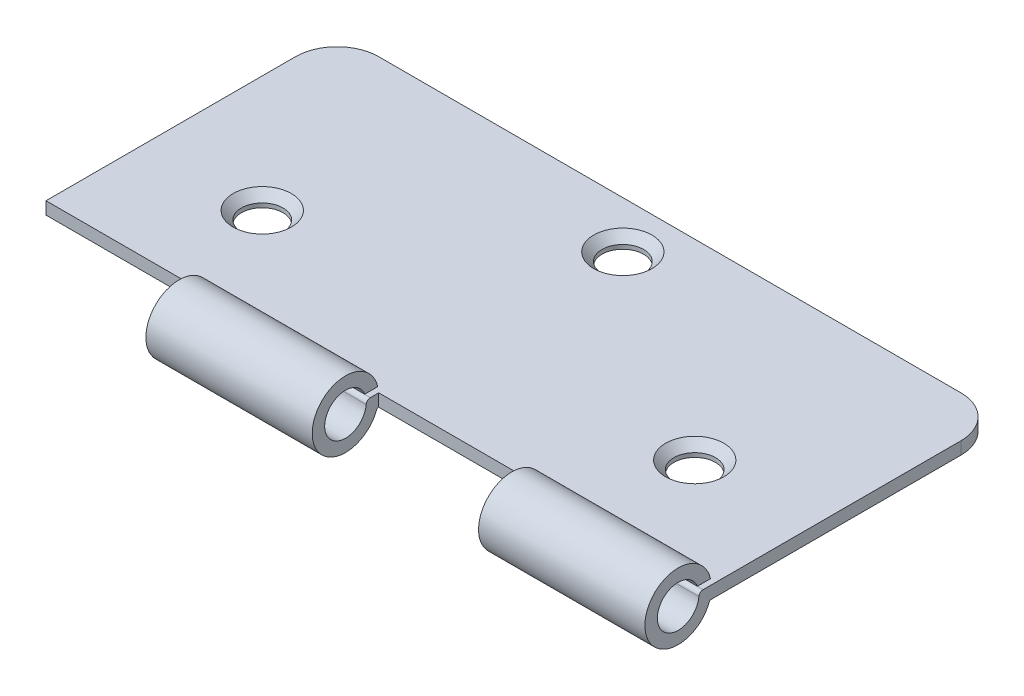
ISO-10303-21;
HEADER;
FILE_DESCRIPTION(('STEP AP214'),'2;1');
FILE_NAME('part.step','',(''),(''),'','','');
FILE_SCHEMA(('AUTOMOTIVE_DESIGN { 1 0 10303 214 1 1 1 1 }'));
ENDSEC;
DATA;
#1=APPLICATION_CONTEXT('core data for automotive mechanical design processes');
#2=APPLICATION_PROTOCOL_DEFINITION('international standard','automotive_design',2000,#1);
#3=PRODUCT_CONTEXT('',#1,'mechanical');
#4=PRODUCT('Part','Part','',(#3));
#5=PRODUCT_RELATED_PRODUCT_CATEGORY('part','',(#4));
#6=PRODUCT_DEFINITION_FORMATION('','',#4);
#7=PRODUCT_DEFINITION_CONTEXT('part definition',#1,'design');
#8=PRODUCT_DEFINITION('design','',#6,#7);
#9=PRODUCT_DEFINITION_SHAPE('','',#8);
#10=(LENGTH_UNIT() NAMED_UNIT(*) SI_UNIT(.MILLI.,.METRE.));
#11=(NAMED_UNIT(*) PLANE_ANGLE_UNIT() SI_UNIT($,.RADIAN.));
#12=(NAMED_UNIT(*) SI_UNIT($,.STERADIAN.) SOLID_ANGLE_UNIT());
#13=UNCERTAINTY_MEASURE_WITH_UNIT(LENGTH_MEASURE(1.E-05),#10,'distance_accuracy_value','');
#14=(GEOMETRIC_REPRESENTATION_CONTEXT(3) GLOBAL_UNCERTAINTY_ASSIGNED_CONTEXT((#13)) GLOBAL_UNIT_ASSIGNED_CONTEXT((#10,
#11,#12)) REPRESENTATION_CONTEXT('',''));
#15=CARTESIAN_POINT('',(0.,0.,0.));
#16=DIRECTION('',(0.,0.,1.));
#17=DIRECTION('',(1.,0.,0.));
#18=AXIS2_PLACEMENT_3D('',#15,#16,#17);
#19=CARTESIAN_POINT('',(-40.,1.5,17.5));
#20=DIRECTION('',(0.,0.,-1.));
#21=DIRECTION('',(-1.,0.,0.));
#22=AXIS2_PLACEMENT_3D('',#19,#20,#21);
#23=PLANE('',#22);
#24=DIRECTION('',(0.,1.,0.));
#25=VECTOR('',#24,1.);
#26=CARTESIAN_POINT('',(0.,1.5,17.5));
#27=LINE('',#26,#25);
#28=CARTESIAN_POINT('',(0.,0.,17.5));
#29=VERTEX_POINT('',#28);
#30=CARTESIAN_POINT('',(0.,1.5,17.5));
#31=VERTEX_POINT('',#30);
#32=EDGE_CURVE('E240',#29,#31,#27,.T.);
#33=ORIENTED_EDGE('',*,*,#32,.F.);
#34=DIRECTION('',(1.,0.,0.));
#35=VECTOR('',#34,1.);
#36=CARTESIAN_POINT('',(-40.,0.,17.5));
#37=LINE('',#36,#35);
#38=CARTESIAN_POINT('',(20.,0.,17.5));
#39=VERTEX_POINT('',#38);
#40=EDGE_CURVE('E368',#29,#39,#37,.T.);
#41=ORIENTED_EDGE('',*,*,#40,.T.);
#42=DIRECTION('',(0.,1.,0.));
#43=VECTOR('',#42,1.);
#44=CARTESIAN_POINT('',(20.,1.5,17.5));
#45=LINE('',#44,#43);
#46=CARTESIAN_POINT('',(20.,1.5,17.5));
#47=VERTEX_POINT('',#46);
#48=EDGE_CURVE('E282',#39,#47,#45,.T.);
#49=ORIENTED_EDGE('',*,*,#48,.T.);
#50=DIRECTION('',(1.,0.,0.));
#51=VECTOR('',#50,1.);
#52=CARTESIAN_POINT('',(-40.,1.5,17.5));
#53=LINE('',#52,#51);
#54=EDGE_CURVE('E57',#31,#47,#53,.T.);
#55=ORIENTED_EDGE('',*,*,#54,.F.);
#56=EDGE_LOOP('',(#33,#41,#49,#55));
#57=FACE_BOUND('',#56,.T.);
#58=ADVANCED_FACE('F41',(#57),#23,.F.);
#59=CARTESIAN_POINT('',(-40.,1.5,17.5));
#60=DIRECTION('',(1.,0.,0.));
#61=DIRECTION('',(0.,0.,-1.));
#62=AXIS2_PLACEMENT_3D('',#59,#60,#61);
#63=PLANE('',#62);
#64=DIRECTION('',(0.,0.,1.));
#65=VECTOR('',#64,1.);
#66=CARTESIAN_POINT('',(-40.,0.,17.5));
#67=LINE('',#66,#65);
#68=CARTESIAN_POINT('',(-40.,0.,-12.5));
#69=VERTEX_POINT('',#68);
#70=CARTESIAN_POINT('',(-40.,0.,17.5));
#71=VERTEX_POINT('',#70);
#72=EDGE_CURVE('E327',#69,#71,#67,.T.);
#73=ORIENTED_EDGE('',*,*,#72,.T.);
#74=DIRECTION('',(0.,-1.,0.));
#75=VECTOR('',#74,1.);
#76=CARTESIAN_POINT('',(-40.,1.5,17.5));
#77=LINE('',#76,#75);
#78=CARTESIAN_POINT('',(-40.,1.5,17.5));
#79=VERTEX_POINT('',#78);
#80=EDGE_CURVE('E398',#79,#71,#77,.T.);
#81=ORIENTED_EDGE('',*,*,#80,.F.);
#82=DIRECTION('',(0.,0.,1.));
#83=VECTOR('',#82,1.);
#84=CARTESIAN_POINT('',(-40.,1.5,17.5));
#85=LINE('',#84,#83);
#86=CARTESIAN_POINT('',(-40.,1.5,-12.5));
#87=VERTEX_POINT('',#86);
#88=EDGE_CURVE('E344',#87,#79,#85,.T.);
#89=ORIENTED_EDGE('',*,*,#88,.F.);
#90=DIRECTION('',(0.,-1.,0.));
#91=VECTOR('',#90,1.);
#92=CARTESIAN_POINT('',(-40.,1.5,-12.5));
#93=LINE('',#92,#91);
#94=EDGE_CURVE('E364',#87,#69,#93,.T.);
#95=ORIENTED_EDGE('',*,*,#94,.T.);
#96=EDGE_LOOP('',(#73,#81,#89,#95));
#97=FACE_BOUND('',#96,.T.);
#98=ADVANCED_FACE('F449',(#97),#63,.F.);
#99=CARTESIAN_POINT('',(-20.,0.,17.5));
#100=VERTEX_POINT('',#99);
#101=EDGE_CURVE('E369',#71,#100,#37,.T.);
#102=ORIENTED_EDGE('',*,*,#101,.T.);
#103=DIRECTION('',(0.,1.,0.));
#104=VECTOR('',#103,1.);
#105=CARTESIAN_POINT('',(-20.,1.5,17.5));
#106=LINE('',#105,#104);
#107=CARTESIAN_POINT('',(-20.,1.5,17.5));
#108=VERTEX_POINT('',#107);
#109=EDGE_CURVE('E65',#100,#108,#106,.T.);
#110=ORIENTED_EDGE('',*,*,#109,.T.);
#111=EDGE_CURVE('E349',#79,#108,#53,.T.);
#112=ORIENTED_EDGE('',*,*,#111,.F.);
#113=ORIENTED_EDGE('',*,*,#80,.T.);
#114=EDGE_LOOP('',(#102,#110,#112,#113));
#115=FACE_BOUND('',#114,.T.);
#116=ADVANCED_FACE('F451',(#115),#23,.F.);
#117=CARTESIAN_POINT('',(40.,1.5,17.5));
#118=DIRECTION('',(-1.,0.,0.));
#119=DIRECTION('',(0.,0.,1.));
#120=AXIS2_PLACEMENT_3D('',#117,#118,#119);
#121=PLANE('',#120);
#122=DIRECTION('',(0.,0.,-1.));
#123=VECTOR('',#122,1.);
#124=CARTESIAN_POINT('',(40.,0.,17.5));
#125=LINE('',#124,#123);
#126=CARTESIAN_POINT('',(40.,0.,17.5553280723627));
#127=VERTEX_POINT('',#126);
#128=CARTESIAN_POINT('',(40.,0.,-12.5));
#129=VERTEX_POINT('',#128);
#130=EDGE_CURVE('E372',#127,#129,#125,.T.);
#131=ORIENTED_EDGE('',*,*,#130,.T.);
#132=DIRECTION('',(0.,-1.,0.));
#133=VECTOR('',#132,1.);
#134=CARTESIAN_POINT('',(40.,1.5,-12.5));
#135=LINE('',#134,#133);
#136=CARTESIAN_POINT('',(40.,1.5,-12.5));
#137=VERTEX_POINT('',#136);
#138=EDGE_CURVE('E394',#137,#129,#135,.T.);
#139=ORIENTED_EDGE('',*,*,#138,.F.);
#140=DIRECTION('',(0.,0.,-1.));
#141=VECTOR('',#140,1.);
#142=CARTESIAN_POINT('',(40.,1.5,17.5));
#143=LINE('',#142,#141);
#144=CARTESIAN_POINT('',(40.,1.5,18.5042880989272));
#145=VERTEX_POINT('',#144);
#146=EDGE_CURVE('E352',#145,#137,#143,.T.);
#147=ORIENTED_EDGE('',*,*,#146,.F.);
#148=CARTESIAN_POINT('',(40.,1.,18.5042880989272));
#149=DIRECTION('',(1.,0.,0.));
#150=DIRECTION('',(0.,0.,-1.));
#151=AXIS2_PLACEMENT_3D('',#148,#149,#150);
#152=CIRCLE('',#151,0.500000000000001);
#153=CARTESIAN_POINT('',(40.,1.04356741446207,19.0023863627237));
#154=VERTEX_POINT('',#153);
#155=EDGE_CURVE('E309',#145,#154,#152,.T.);
#156=ORIENTED_EDGE('',*,*,#155,.T.);
#157=CARTESIAN_POINT('',(40.,1.2614044867724,21.4928776817062));
#158=DIRECTION('',(-1.,0.,0.));
#159=DIRECTION('',(0.,0.,-1.));
#160=AXIS2_PLACEMENT_3D('',#157,#158,#159);
#161=CIRCLE('',#160,2.5);
#162=CARTESIAN_POINT('',(40.,2.19386766545914,19.1732845233284));
#163=VERTEX_POINT('',#162);
#164=EDGE_CURVE('E313',#154,#163,#161,.T.);
#165=ORIENTED_EDGE('',*,*,#164,.T.);
#166=DIRECTION('',(0.,0.,-1.));
#167=VECTOR('',#166,1.);
#168=CARTESIAN_POINT('',(40.,2.19386766545914,19.1732845233284));
#169=LINE('',#168,#167);
#170=CARTESIAN_POINT('',(40.,2.19386766545914,17.6030817461341));
#171=VERTEX_POINT('',#170);
#172=EDGE_CURVE('E317',#163,#171,#169,.T.);
#173=ORIENTED_EDGE('',*,*,#172,.T.);
#174=CARTESIAN_POINT('',(40.,1.2614044867724,21.4928776817062));
#175=DIRECTION('',(1.,0.,0.));
#176=DIRECTION('',(0.,0.,-1.));
#177=AXIS2_PLACEMENT_3D('',#174,#175,#176);
#178=CIRCLE('',#177,4.);
#179=CARTESIAN_POINT('',(40.,-0.130409310153694,17.7428304347124));
#180=VERTEX_POINT('',#179);
#181=EDGE_CURVE('E278',#171,#180,#178,.T.);
#182=ORIENTED_EDGE('',*,*,#181,.T.);
#183=CARTESIAN_POINT('',(40.,-0.2,17.5553280723627));
#184=DIRECTION('',(-1.,0.,0.));
#185=DIRECTION('',(0.,0.,1.));
#186=AXIS2_PLACEMENT_3D('',#183,#184,#185);
#187=CIRCLE('',#186,0.199999999999999);
#188=EDGE_CURVE('E261',#180,#127,#187,.T.);
#189=ORIENTED_EDGE('',*,*,#188,.T.);
#190=EDGE_LOOP('',(#131,#139,#147,#156,#165,#173,#182,#189));
#191=FACE_BOUND('',#190,.T.);
#192=ADVANCED_FACE('F459',(#191),#121,.F.);
#193=CARTESIAN_POINT('',(35.,1.5,-12.5));
#194=DIRECTION('',(0.,-1.,0.));
#195=DIRECTION('',(0.,0.,-1.));
#196=AXIS2_PLACEMENT_3D('',#193,#194,#195);
#197=CYLINDRICAL_SURFACE('',#196,5.);
#198=CARTESIAN_POINT('',(35.,0.,-12.5));
#199=DIRECTION('',(0.,1.,0.));
#200=DIRECTION('',(0.,0.,-1.));
#201=AXIS2_PLACEMENT_3D('',#198,#199,#200);
#202=CIRCLE('',#201,5.);
#203=CARTESIAN_POINT('',(35.,0.,-17.5));
#204=VERTEX_POINT('',#203);
#205=EDGE_CURVE('E375',#129,#204,#202,.T.);
#206=ORIENTED_EDGE('',*,*,#205,.T.);
#207=DIRECTION('',(0.,-1.,0.));
#208=VECTOR('',#207,1.);
#209=CARTESIAN_POINT('',(35.,1.5,-17.5));
#210=LINE('',#209,#208);
#211=CARTESIAN_POINT('',(35.,1.5,-17.5));
#212=VERTEX_POINT('',#211);
#213=EDGE_CURVE('E390',#212,#204,#210,.T.);
#214=ORIENTED_EDGE('',*,*,#213,.F.);
#215=CARTESIAN_POINT('',(35.,1.5,-12.5));
#216=DIRECTION('',(0.,1.,0.));
#217=DIRECTION('',(0.,0.,-1.));
#218=AXIS2_PLACEMENT_3D('',#215,#216,#217);
#219=CIRCLE('',#218,5.);
#220=EDGE_CURVE('E355',#137,#212,#219,.T.);
#221=ORIENTED_EDGE('',*,*,#220,.F.);
#222=ORIENTED_EDGE('',*,*,#138,.T.);
#223=EDGE_LOOP('',(#206,#214,#221,#222));
#224=FACE_BOUND('',#223,.T.);
#225=ADVANCED_FACE('F463',(#224),#197,.T.);
#226=CARTESIAN_POINT('',(-35.,1.5,-17.5));
#227=DIRECTION('',(0.,0.,1.));
#228=DIRECTION('',(1.,0.,0.));
#229=AXIS2_PLACEMENT_3D('',#226,#227,#228);
#230=PLANE('',#229);
#231=DIRECTION('',(-1.,0.,0.));
#232=VECTOR('',#231,1.);
#233=CARTESIAN_POINT('',(-35.,0.,-17.5));
#234=LINE('',#233,#232);
#235=CARTESIAN_POINT('',(-35.,0.,-17.5));
#236=VERTEX_POINT('',#235);
#237=EDGE_CURVE('E378',#204,#236,#234,.T.);
#238=ORIENTED_EDGE('',*,*,#237,.T.);
#239=DIRECTION('',(0.,-1.,0.));
#240=VECTOR('',#239,1.);
#241=CARTESIAN_POINT('',(-35.,1.5,-17.5));
#242=LINE('',#241,#240);
#243=CARTESIAN_POINT('',(-35.,1.5,-17.5));
#244=VERTEX_POINT('',#243);
#245=EDGE_CURVE('E386',#244,#236,#242,.T.);
#246=ORIENTED_EDGE('',*,*,#245,.F.);
#247=DIRECTION('',(-1.,0.,0.));
#248=VECTOR('',#247,1.);
#249=CARTESIAN_POINT('',(-35.,1.5,-17.5));
#250=LINE('',#249,#248);
#251=EDGE_CURVE('E358',#212,#244,#250,.T.);
#252=ORIENTED_EDGE('',*,*,#251,.F.);
#253=ORIENTED_EDGE('',*,*,#213,.T.);
#254=EDGE_LOOP('',(#238,#246,#252,#253));
#255=FACE_BOUND('',#254,.T.);
#256=ADVANCED_FACE('F476',(#255),#230,.F.);
#257=CARTESIAN_POINT('',(-35.,1.5,-12.5));
#258=DIRECTION('',(0.,-1.,0.));
#259=DIRECTION('',(0.,0.,-1.));
#260=AXIS2_PLACEMENT_3D('',#257,#258,#259);
#261=CYLINDRICAL_SURFACE('',#260,5.);
#262=CARTESIAN_POINT('',(-35.,0.,-12.5));
#263=DIRECTION('',(0.,1.,0.));
#264=DIRECTION('',(0.,0.,-1.));
#265=AXIS2_PLACEMENT_3D('',#262,#263,#264);
#266=CIRCLE('',#265,5.);
#267=EDGE_CURVE('E348',#236,#69,#266,.T.);
#268=ORIENTED_EDGE('',*,*,#267,.T.);
#269=ORIENTED_EDGE('',*,*,#94,.F.);
#270=CARTESIAN_POINT('',(-35.,1.5,-12.5));
#271=DIRECTION('',(0.,1.,0.));
#272=DIRECTION('',(0.,0.,-1.));
#273=AXIS2_PLACEMENT_3D('',#270,#271,#272);
#274=CIRCLE('',#273,5.);
#275=EDGE_CURVE('E361',#244,#87,#274,.T.);
#276=ORIENTED_EDGE('',*,*,#275,.F.);
#277=ORIENTED_EDGE('',*,*,#245,.T.);
#278=EDGE_LOOP('',(#268,#269,#276,#277));
#279=FACE_BOUND('',#278,.T.);
#280=ADVANCED_FACE('F472',(#279),#261,.T.);
#281=CARTESIAN_POINT('',(-35.,1.5,-12.5));
#282=DIRECTION('',(0.,-1.,0.));
#283=DIRECTION('',(0.,0.,-1.));
#284=AXIS2_PLACEMENT_3D('',#281,#282,#283);
#285=PLANE('',#284);
#286=CARTESIAN_POINT('',(26.,1.5,5.50000000000001));
#287=DIRECTION('',(0.,-1.,0.));
#288=DIRECTION('',(0.,0.,-1.));
#289=AXIS2_PLACEMENT_3D('',#286,#287,#288);
#290=CIRCLE('',#289,3.50000000000002);
#291=CARTESIAN_POINT('',(26.,1.5,1.99999999999999));
#292=VERTEX_POINT('',#291);
#293=EDGE_CURVE('E425',#292,#292,#290,.T.);
#294=ORIENTED_EDGE('',*,*,#293,.T.);
#295=EDGE_LOOP('',(#294));
#296=FACE_BOUND('',#295,.T.);
#297=CARTESIAN_POINT('',(0.,1.5,-11.85566873972));
#298=DIRECTION('',(0.,-1.,0.));
#299=DIRECTION('',(0.,0.,-1.));
#300=AXIS2_PLACEMENT_3D('',#297,#298,#299);
#301=CIRCLE('',#300,3.50000000000002);
#302=CARTESIAN_POINT('',(0.,1.5,-15.35566873972));
#303=VERTEX_POINT('',#302);
#304=EDGE_CURVE('E421',#303,#303,#301,.T.);
#305=ORIENTED_EDGE('',*,*,#304,.T.);
#306=EDGE_LOOP('',(#305));
#307=FACE_BOUND('',#306,.T.);
#308=CARTESIAN_POINT('',(-26.,1.5,5.50000000000001));
#309=DIRECTION('',(0.,-1.,0.));
#310=DIRECTION('',(0.,0.,-1.));
#311=AXIS2_PLACEMENT_3D('',#308,#309,#310);
#312=CIRCLE('',#311,3.50000000000002);
#313=CARTESIAN_POINT('',(-26.,1.5,1.99999999999999));
#314=VERTEX_POINT('',#313);
#315=EDGE_CURVE('E417',#314,#314,#312,.T.);
#316=ORIENTED_EDGE('',*,*,#315,.T.);
#317=EDGE_LOOP('',(#316));
#318=FACE_BOUND('',#317,.T.);
#319=ORIENTED_EDGE('',*,*,#88,.T.);
#320=ORIENTED_EDGE('',*,*,#111,.T.);
#321=DIRECTION('',(0.,0.,1.));
#322=VECTOR('',#321,1.);
#323=CARTESIAN_POINT('',(-20.,1.5,17.5));
#324=LINE('',#323,#322);
#325=CARTESIAN_POINT('',(-20.,1.5,18.5042880989272));
#326=VERTEX_POINT('',#325);
#327=EDGE_CURVE('E216',#108,#326,#324,.T.);
#328=ORIENTED_EDGE('',*,*,#327,.T.);
#329=DIRECTION('',(1.,0.,0.));
#330=VECTOR('',#329,1.);
#331=CARTESIAN_POINT('',(-20.,1.5,18.5042880989272));
#332=LINE('',#331,#330);
#333=CARTESIAN_POINT('',(0.,1.5,18.5042880989272));
#334=VERTEX_POINT('',#333);
#335=EDGE_CURVE('E192',#326,#334,#332,.T.);
#336=ORIENTED_EDGE('',*,*,#335,.T.);
#337=DIRECTION('',(0.,0.,1.));
#338=VECTOR('',#337,1.);
#339=CARTESIAN_POINT('',(0.,1.5,17.5));
#340=LINE('',#339,#338);
#341=EDGE_CURVE('E244',#31,#334,#340,.T.);
#342=ORIENTED_EDGE('',*,*,#341,.F.);
#343=ORIENTED_EDGE('',*,*,#54,.T.);
#344=DIRECTION('',(0.,0.,1.));
#345=VECTOR('',#344,1.);
#346=CARTESIAN_POINT('',(20.,1.5,17.5));
#347=LINE('',#346,#345);
#348=CARTESIAN_POINT('',(20.,1.5,18.5042880989272));
#349=VERTEX_POINT('',#348);
#350=EDGE_CURVE('E285',#47,#349,#347,.T.);
#351=ORIENTED_EDGE('',*,*,#350,.T.);
#352=DIRECTION('',(1.,0.,0.));
#353=VECTOR('',#352,1.);
#354=CARTESIAN_POINT('',(20.,1.5,18.5042880989272));
#355=LINE('',#354,#353);
#356=EDGE_CURVE('E337',#349,#145,#355,.T.);
#357=ORIENTED_EDGE('',*,*,#356,.T.);
#358=ORIENTED_EDGE('',*,*,#146,.T.);
#359=ORIENTED_EDGE('',*,*,#220,.T.);
#360=ORIENTED_EDGE('',*,*,#251,.T.);
#361=ORIENTED_EDGE('',*,*,#275,.T.);
#362=EDGE_LOOP('',(#319,#320,#328,#336,#342,#343,#351,#357,#358,#359,#360,#361));
#363=FACE_BOUND('',#362,.T.);
#364=ADVANCED_FACE('F497',(#296,#307,#318,#363),#285,.F.);
#365=CARTESIAN_POINT('',(-35.,0.,-12.5));
#366=DIRECTION('',(0.,-1.,0.));
#367=DIRECTION('',(0.,0.,-1.));
#368=AXIS2_PLACEMENT_3D('',#365,#366,#367);
#369=PLANE('',#368);
#370=CARTESIAN_POINT('',(-26.,0.,5.50000000000001));
#371=DIRECTION('',(0.,-1.,0.));
#372=DIRECTION('',(0.,0.,-1.));
#373=AXIS2_PLACEMENT_3D('',#370,#371,#372);
#374=CIRCLE('',#373,2.5);
#375=CARTESIAN_POINT('',(-26.,0.,3.00000000000001));
#376=VERTEX_POINT('',#375);
#377=EDGE_CURVE('E237',#376,#376,#374,.T.);
#378=ORIENTED_EDGE('',*,*,#377,.F.);
#379=EDGE_LOOP('',(#378));
#380=FACE_BOUND('',#379,.T.);
#381=CARTESIAN_POINT('',(26.,0.,5.50000000000001));
#382=DIRECTION('',(0.,-1.,0.));
#383=DIRECTION('',(0.,0.,-1.));
#384=AXIS2_PLACEMENT_3D('',#381,#382,#383);
#385=CIRCLE('',#384,2.5);
#386=CARTESIAN_POINT('',(26.,0.,3.00000000000001));
#387=VERTEX_POINT('',#386);
#388=EDGE_CURVE('E407',#387,#387,#385,.T.);
#389=ORIENTED_EDGE('',*,*,#388,.F.);
#390=EDGE_LOOP('',(#389));
#391=FACE_BOUND('',#390,.T.);
#392=CARTESIAN_POINT('',(0.,0.,-11.85566873972));
#393=DIRECTION('',(0.,-1.,0.));
#394=DIRECTION('',(0.,0.,-1.));
#395=AXIS2_PLACEMENT_3D('',#392,#393,#394);
#396=CIRCLE('',#395,2.5);
#397=CARTESIAN_POINT('',(0.,0.,-14.35566873972));
#398=VERTEX_POINT('',#397);
#399=EDGE_CURVE('E403',#398,#398,#396,.T.);
#400=ORIENTED_EDGE('',*,*,#399,.F.);
#401=EDGE_LOOP('',(#400));
#402=FACE_BOUND('',#401,.T.);
#403=ORIENTED_EDGE('',*,*,#72,.F.);
#404=ORIENTED_EDGE('',*,*,#267,.F.);
#405=ORIENTED_EDGE('',*,*,#237,.F.);
#406=ORIENTED_EDGE('',*,*,#205,.F.);
#407=ORIENTED_EDGE('',*,*,#130,.F.);
#408=DIRECTION('',(1.,0.,0.));
#409=VECTOR('',#408,1.);
#410=CARTESIAN_POINT('',(20.,0.,17.5553280723627));
#411=LINE('',#410,#409);
#412=CARTESIAN_POINT('',(20.,0.,17.5553280723627));
#413=VERTEX_POINT('',#412);
#414=EDGE_CURVE('E305',#413,#127,#411,.T.);
#415=ORIENTED_EDGE('',*,*,#414,.F.);
#416=DIRECTION('',(0.,0.,-1.));
#417=VECTOR('',#416,1.);
#418=CARTESIAN_POINT('',(20.,0.,17.5));
#419=LINE('',#418,#417);
#420=EDGE_CURVE('E277',#413,#39,#419,.T.);
#421=ORIENTED_EDGE('',*,*,#420,.T.);
#422=ORIENTED_EDGE('',*,*,#40,.F.);
#423=DIRECTION('',(0.,0.,-1.));
#424=VECTOR('',#423,1.);
#425=CARTESIAN_POINT('',(0.,0.,17.5));
#426=LINE('',#425,#424);
#427=CARTESIAN_POINT('',(0.,0.,17.5553280723627));
#428=VERTEX_POINT('',#427);
#429=EDGE_CURVE('E186',#428,#29,#426,.T.);
#430=ORIENTED_EDGE('',*,*,#429,.F.);
#431=DIRECTION('',(1.,0.,0.));
#432=VECTOR('',#431,1.);
#433=CARTESIAN_POINT('',(-20.,0.,17.5553280723627));
#434=LINE('',#433,#432);
#435=CARTESIAN_POINT('',(-20.,0.,17.5553280723627));
#436=VERTEX_POINT('',#435);
#437=EDGE_CURVE('E180',#436,#428,#434,.T.);
#438=ORIENTED_EDGE('',*,*,#437,.F.);
#439=DIRECTION('',(0.,0.,-1.));
#440=VECTOR('',#439,1.);
#441=CARTESIAN_POINT('',(-20.,0.,17.5));
#442=LINE('',#441,#440);
#443=EDGE_CURVE('E184',#436,#100,#442,.T.);
#444=ORIENTED_EDGE('',*,*,#443,.T.);
#445=ORIENTED_EDGE('',*,*,#101,.F.);
#446=EDGE_LOOP('',(#403,#404,#405,#406,#407,#415,#421,#422,#430,#438,#444,#445));
#447=FACE_BOUND('',#446,.T.);
#448=ADVANCED_FACE('F183',(#380,#391,#402,#447),#369,.T.);
#449=CARTESIAN_POINT('',(20.,-0.2,17.5553280723627));
#450=DIRECTION('',(1.,0.,0.));
#451=DIRECTION('',(0.,0.,-1.));
#452=AXIS2_PLACEMENT_3D('',#449,#450,#451);
#453=CYLINDRICAL_SURFACE('',#452,0.199999999999999);
#454=ORIENTED_EDGE('',*,*,#188,.F.);
#455=DIRECTION('',(1.,0.,0.));
#456=VECTOR('',#455,1.);
#457=CARTESIAN_POINT('',(20.,-0.130409310153694,17.7428304347124));
#458=LINE('',#457,#456);
#459=CARTESIAN_POINT('',(20.,-0.130409310153694,17.7428304347124));
#460=VERTEX_POINT('',#459);
#461=EDGE_CURVE('E324',#460,#180,#458,.T.);
#462=ORIENTED_EDGE('',*,*,#461,.F.);
#463=CARTESIAN_POINT('',(20.,-0.2,17.5553280723627));
#464=DIRECTION('',(-1.,0.,0.));
#465=DIRECTION('',(0.,0.,1.));
#466=AXIS2_PLACEMENT_3D('',#463,#464,#465);
#467=CIRCLE('',#466,0.199999999999999);
#468=EDGE_CURVE('E273',#460,#413,#467,.T.);
#469=ORIENTED_EDGE('',*,*,#468,.T.);
#470=ORIENTED_EDGE('',*,*,#414,.T.);
#471=EDGE_LOOP('',(#454,#462,#469,#470));
#472=FACE_BOUND('',#471,.T.);
#473=ADVANCED_FACE('F485',(#472),#453,.F.);
#474=CARTESIAN_POINT('',(20.,1.2614044867724,21.4928776817062));
#475=DIRECTION('',(1.,0.,0.));
#476=DIRECTION('',(0.,0.,-1.));
#477=AXIS2_PLACEMENT_3D('',#474,#475,#476);
#478=CYLINDRICAL_SURFACE('',#477,4.);
#479=ORIENTED_EDGE('',*,*,#181,.F.);
#480=DIRECTION('',(1.,0.,0.));
#481=VECTOR('',#480,1.);
#482=CARTESIAN_POINT('',(20.,2.19386766545914,17.6030817461341));
#483=LINE('',#482,#481);
#484=CARTESIAN_POINT('',(20.,2.19386766545914,17.6030817461341));
#485=VERTEX_POINT('',#484);
#486=EDGE_CURVE('E328',#485,#171,#483,.T.);
#487=ORIENTED_EDGE('',*,*,#486,.F.);
#488=CARTESIAN_POINT('',(20.,1.2614044867724,21.4928776817062));
#489=DIRECTION('',(1.,0.,0.));
#490=DIRECTION('',(0.,0.,-1.));
#491=AXIS2_PLACEMENT_3D('',#488,#489,#490);
#492=CIRCLE('',#491,4.);
#493=EDGE_CURVE('E301',#485,#460,#492,.T.);
#494=ORIENTED_EDGE('',*,*,#493,.T.);
#495=ORIENTED_EDGE('',*,*,#461,.T.);
#496=EDGE_LOOP('',(#479,#487,#494,#495));
#497=FACE_BOUND('',#496,.T.);
#498=ADVANCED_FACE('F526',(#497),#478,.T.);
#499=CARTESIAN_POINT('',(20.,2.19386766545914,19.1732845233284));
#500=DIRECTION('',(0.,-1.,0.));
#501=DIRECTION('',(0.,0.,-1.));
#502=AXIS2_PLACEMENT_3D('',#499,#500,#501);
#503=PLANE('',#502);
#504=ORIENTED_EDGE('',*,*,#172,.F.);
#505=DIRECTION('',(1.,0.,0.));
#506=VECTOR('',#505,1.);
#507=CARTESIAN_POINT('',(20.,2.19386766545914,19.1732845233284));
#508=LINE('',#507,#506);
#509=CARTESIAN_POINT('',(20.,2.19386766545914,19.1732845233284));
#510=VERTEX_POINT('',#509);
#511=EDGE_CURVE('E331',#510,#163,#508,.T.);
#512=ORIENTED_EDGE('',*,*,#511,.F.);
#513=DIRECTION('',(0.,0.,-1.));
#514=VECTOR('',#513,1.);
#515=CARTESIAN_POINT('',(20.,2.19386766545914,19.1732845233284));
#516=LINE('',#515,#514);
#517=EDGE_CURVE('E297',#510,#485,#516,.T.);
#518=ORIENTED_EDGE('',*,*,#517,.T.);
#519=ORIENTED_EDGE('',*,*,#486,.T.);
#520=EDGE_LOOP('',(#504,#512,#518,#519));
#521=FACE_BOUND('',#520,.T.);
#522=ADVANCED_FACE('F524',(#521),#503,.T.);
#523=CARTESIAN_POINT('',(20.,1.2614044867724,21.4928776817062));
#524=DIRECTION('',(1.,0.,0.));
#525=DIRECTION('',(0.,0.,-1.));
#526=AXIS2_PLACEMENT_3D('',#523,#524,#525);
#527=CYLINDRICAL_SURFACE('',#526,2.5);
#528=ORIENTED_EDGE('',*,*,#164,.F.);
#529=DIRECTION('',(1.,0.,0.));
#530=VECTOR('',#529,1.);
#531=CARTESIAN_POINT('',(20.,1.04356741446207,19.0023863627237));
#532=LINE('',#531,#530);
#533=CARTESIAN_POINT('',(20.,1.04356741446207,19.0023863627237));
#534=VERTEX_POINT('',#533);
#535=EDGE_CURVE('E334',#534,#154,#532,.T.);
#536=ORIENTED_EDGE('',*,*,#535,.F.);
#537=CARTESIAN_POINT('',(20.,1.2614044867724,21.4928776817062));
#538=DIRECTION('',(-1.,0.,0.));
#539=DIRECTION('',(0.,0.,-1.));
#540=AXIS2_PLACEMENT_3D('',#537,#538,#539);
#541=CIRCLE('',#540,2.5);
#542=EDGE_CURVE('E293',#534,#510,#541,.T.);
#543=ORIENTED_EDGE('',*,*,#542,.T.);
#544=ORIENTED_EDGE('',*,*,#511,.T.);
#545=EDGE_LOOP('',(#528,#536,#543,#544));
#546=FACE_BOUND('',#545,.T.);
#547=ADVANCED_FACE('F520',(#546),#527,.F.);
#548=CARTESIAN_POINT('',(20.,1.,18.5042880989272));
#549=DIRECTION('',(1.,0.,0.));
#550=DIRECTION('',(0.,0.,-1.));
#551=AXIS2_PLACEMENT_3D('',#548,#549,#550);
#552=CYLINDRICAL_SURFACE('',#551,0.500000000000001);
#553=ORIENTED_EDGE('',*,*,#155,.F.);
#554=ORIENTED_EDGE('',*,*,#356,.F.);
#555=CARTESIAN_POINT('',(20.,1.,18.5042880989272));
#556=DIRECTION('',(1.,0.,0.));
#557=DIRECTION('',(0.,0.,-1.));
#558=AXIS2_PLACEMENT_3D('',#555,#556,#557);
#559=CIRCLE('',#558,0.500000000000001);
#560=EDGE_CURVE('E289',#349,#534,#559,.T.);
#561=ORIENTED_EDGE('',*,*,#560,.T.);
#562=ORIENTED_EDGE('',*,*,#535,.T.);
#563=EDGE_LOOP('',(#553,#554,#561,#562));
#564=FACE_BOUND('',#563,.T.);
#565=ADVANCED_FACE('F516',(#564),#552,.T.);
#566=CARTESIAN_POINT('',(20.,-0.2,17.5553280723627));
#567=DIRECTION('',(-1.,0.,0.));
#568=DIRECTION('',(0.,0.,1.));
#569=AXIS2_PLACEMENT_3D('',#566,#567,#568);
#570=PLANE('',#569);
#571=ORIENTED_EDGE('',*,*,#468,.F.);
#572=ORIENTED_EDGE('',*,*,#493,.F.);
#573=ORIENTED_EDGE('',*,*,#517,.F.);
#574=ORIENTED_EDGE('',*,*,#542,.F.);
#575=ORIENTED_EDGE('',*,*,#560,.F.);
#576=ORIENTED_EDGE('',*,*,#350,.F.);
#577=ORIENTED_EDGE('',*,*,#48,.F.);
#578=ORIENTED_EDGE('',*,*,#420,.F.);
#579=EDGE_LOOP('',(#571,#572,#573,#574,#575,#576,#577,#578));
#580=FACE_BOUND('',#579,.T.);
#581=ADVANCED_FACE('F490',(#580),#570,.T.);
#582=CARTESIAN_POINT('',(-20.,-0.2,17.5553280723627));
#583=DIRECTION('',(1.,0.,0.));
#584=DIRECTION('',(0.,0.,-1.));
#585=AXIS2_PLACEMENT_3D('',#582,#583,#584);
#586=CYLINDRICAL_SURFACE('',#585,0.199999999999999);
#587=CARTESIAN_POINT('',(0.,-0.2,17.5553280723627));
#588=DIRECTION('',(-1.,0.,0.));
#589=DIRECTION('',(0.,0.,1.));
#590=AXIS2_PLACEMENT_3D('',#587,#588,#589);
#591=CIRCLE('',#590,0.199999999999999);
#592=CARTESIAN_POINT('',(0.,-0.130409310153694,17.7428304347124));
#593=VERTEX_POINT('',#592);
#594=EDGE_CURVE('E234',#593,#428,#591,.T.);
#595=ORIENTED_EDGE('',*,*,#594,.F.);
#596=DIRECTION('',(1.,0.,0.));
#597=VECTOR('',#596,1.);
#598=CARTESIAN_POINT('',(-20.,-0.130409310153694,17.7428304347124));
#599=LINE('',#598,#597);
#600=CARTESIAN_POINT('',(-20.,-0.130409310153694,17.7428304347124));
#601=VERTEX_POINT('',#600);
#602=EDGE_CURVE('E205',#601,#593,#599,.T.);
#603=ORIENTED_EDGE('',*,*,#602,.F.);
#604=CARTESIAN_POINT('',(-20.,-0.2,17.5553280723627));
#605=DIRECTION('',(-1.,0.,0.));
#606=DIRECTION('',(0.,0.,1.));
#607=AXIS2_PLACEMENT_3D('',#604,#605,#606);
#608=CIRCLE('',#607,0.199999999999999);
#609=EDGE_CURVE('E199',#601,#436,#608,.T.);
#610=ORIENTED_EDGE('',*,*,#609,.T.);
#611=ORIENTED_EDGE('',*,*,#437,.T.);
#612=EDGE_LOOP('',(#595,#603,#610,#611));
#613=FACE_BOUND('',#612,.T.);
#614=ADVANCED_FACE('F204',(#613),#586,.F.);
#615=CARTESIAN_POINT('',(-20.,1.2614044867724,21.4928776817062));
#616=DIRECTION('',(1.,0.,0.));
#617=DIRECTION('',(0.,0.,-1.));
#618=AXIS2_PLACEMENT_3D('',#615,#616,#617);
#619=CYLINDRICAL_SURFACE('',#618,4.);
#620=CARTESIAN_POINT('',(0.,1.2614044867724,21.4928776817062));
#621=DIRECTION('',(1.,0.,0.));
#622=DIRECTION('',(0.,0.,-1.));
#623=AXIS2_PLACEMENT_3D('',#620,#621,#622);
#624=CIRCLE('',#623,4.);
#625=CARTESIAN_POINT('',(0.,2.19386766545914,17.6030817461341));
#626=VERTEX_POINT('',#625);
#627=EDGE_CURVE('E207',#626,#593,#624,.T.);
#628=ORIENTED_EDGE('',*,*,#627,.F.);
#629=DIRECTION('',(1.,0.,0.));
#630=VECTOR('',#629,1.);
#631=CARTESIAN_POINT('',(-20.,2.19386766545914,17.6030817461341));
#632=LINE('',#631,#630);
#633=CARTESIAN_POINT('',(-20.,2.19386766545914,17.6030817461341));
#634=VERTEX_POINT('',#633);
#635=EDGE_CURVE('E262',#634,#626,#632,.T.);
#636=ORIENTED_EDGE('',*,*,#635,.F.);
#637=CARTESIAN_POINT('',(-20.,1.2614044867724,21.4928776817062));
#638=DIRECTION('',(1.,0.,0.));
#639=DIRECTION('',(0.,0.,-1.));
#640=AXIS2_PLACEMENT_3D('',#637,#638,#639);
#641=CIRCLE('',#640,4.);
#642=EDGE_CURVE('E193',#634,#601,#641,.T.);
#643=ORIENTED_EDGE('',*,*,#642,.T.);
#644=ORIENTED_EDGE('',*,*,#602,.T.);
#645=EDGE_LOOP('',(#628,#636,#643,#644));
#646=FACE_BOUND('',#645,.T.);
#647=ADVANCED_FACE('F504',(#646),#619,.T.);
#648=CARTESIAN_POINT('',(-20.,2.19386766545914,19.1732845233284));
#649=DIRECTION('',(0.,-1.,0.));
#650=DIRECTION('',(0.,0.,-1.));
#651=AXIS2_PLACEMENT_3D('',#648,#649,#650);
#652=PLANE('',#651);
#653=DIRECTION('',(0.,0.,-1.));
#654=VECTOR('',#653,1.);
#655=CARTESIAN_POINT('',(0.,2.19386766545914,19.1732845233284));
#656=LINE('',#655,#654);
#657=CARTESIAN_POINT('',(0.,2.19386766545914,19.1732845233284));
#658=VERTEX_POINT('',#657);
#659=EDGE_CURVE('E211',#658,#626,#656,.T.);
#660=ORIENTED_EDGE('',*,*,#659,.F.);
#661=DIRECTION('',(1.,0.,0.));
#662=VECTOR('',#661,1.);
#663=CARTESIAN_POINT('',(-20.,2.19386766545914,19.1732845233284));
#664=LINE('',#663,#662);
#665=CARTESIAN_POINT('',(-20.,2.19386766545914,19.1732845233284));
#666=VERTEX_POINT('',#665);
#667=EDGE_CURVE('E265',#666,#658,#664,.T.);
#668=ORIENTED_EDGE('',*,*,#667,.F.);
#669=DIRECTION('',(0.,0.,-1.));
#670=VECTOR('',#669,1.);
#671=CARTESIAN_POINT('',(-20.,2.19386766545914,19.1732845233284));
#672=LINE('',#671,#670);
#673=EDGE_CURVE('E228',#666,#634,#672,.T.);
#674=ORIENTED_EDGE('',*,*,#673,.T.);
#675=ORIENTED_EDGE('',*,*,#635,.T.);
#676=EDGE_LOOP('',(#660,#668,#674,#675));
#677=FACE_BOUND('',#676,.T.);
#678=ADVANCED_FACE('F638',(#677),#652,.T.);
#679=CARTESIAN_POINT('',(-20.,1.2614044867724,21.4928776817062));
#680=DIRECTION('',(1.,0.,0.));
#681=DIRECTION('',(0.,0.,-1.));
#682=AXIS2_PLACEMENT_3D('',#679,#680,#681);
#683=CYLINDRICAL_SURFACE('',#682,2.5);
#684=CARTESIAN_POINT('',(0.,1.2614044867724,21.4928776817062));
#685=DIRECTION('',(-1.,0.,0.));
#686=DIRECTION('',(0.,0.,-1.));
#687=AXIS2_PLACEMENT_3D('',#684,#685,#686);
#688=CIRCLE('',#687,2.5);
#689=CARTESIAN_POINT('',(0.,1.04356741446207,19.0023863627237));
#690=VERTEX_POINT('',#689);
#691=EDGE_CURVE('E252',#690,#658,#688,.T.);
#692=ORIENTED_EDGE('',*,*,#691,.F.);
#693=DIRECTION('',(1.,0.,0.));
#694=VECTOR('',#693,1.);
#695=CARTESIAN_POINT('',(-20.,1.04356741446207,19.0023863627237));
#696=LINE('',#695,#694);
#697=CARTESIAN_POINT('',(-20.,1.04356741446207,19.0023863627237));
#698=VERTEX_POINT('',#697);
#699=EDGE_CURVE('E268',#698,#690,#696,.T.);
#700=ORIENTED_EDGE('',*,*,#699,.F.);
#701=CARTESIAN_POINT('',(-20.,1.2614044867724,21.4928776817062));
#702=DIRECTION('',(-1.,0.,0.));
#703=DIRECTION('',(0.,0.,-1.));
#704=AXIS2_PLACEMENT_3D('',#701,#702,#703);
#705=CIRCLE('',#704,2.5);
#706=EDGE_CURVE('E224',#698,#666,#705,.T.);
#707=ORIENTED_EDGE('',*,*,#706,.T.);
#708=ORIENTED_EDGE('',*,*,#667,.T.);
#709=EDGE_LOOP('',(#692,#700,#707,#708));
#710=FACE_BOUND('',#709,.T.);
#711=ADVANCED_FACE('F511',(#710),#683,.F.);
#712=CARTESIAN_POINT('',(-20.,1.,18.5042880989272));
#713=DIRECTION('',(1.,0.,0.));
#714=DIRECTION('',(0.,0.,-1.));
#715=AXIS2_PLACEMENT_3D('',#712,#713,#714);
#716=CYLINDRICAL_SURFACE('',#715,0.500000000000001);
#717=CARTESIAN_POINT('',(0.,1.,18.5042880989272));
#718=DIRECTION('',(1.,0.,0.));
#719=DIRECTION('',(0.,0.,-1.));
#720=AXIS2_PLACEMENT_3D('',#717,#718,#719);
#721=CIRCLE('',#720,0.500000000000001);
#722=EDGE_CURVE('E248',#334,#690,#721,.T.);
#723=ORIENTED_EDGE('',*,*,#722,.F.);
#724=ORIENTED_EDGE('',*,*,#335,.F.);
#725=CARTESIAN_POINT('',(-20.,1.,18.5042880989272));
#726=DIRECTION('',(1.,0.,0.));
#727=DIRECTION('',(0.,0.,-1.));
#728=AXIS2_PLACEMENT_3D('',#725,#726,#727);
#729=CIRCLE('',#728,0.500000000000001);
#730=EDGE_CURVE('E220',#326,#698,#729,.T.);
#731=ORIENTED_EDGE('',*,*,#730,.T.);
#732=ORIENTED_EDGE('',*,*,#699,.T.);
#733=EDGE_LOOP('',(#723,#724,#731,#732));
#734=FACE_BOUND('',#733,.T.);
#735=ADVANCED_FACE('F513',(#734),#716,.T.);
#736=CARTESIAN_POINT('',(-20.,-0.2,17.5553280723627));
#737=DIRECTION('',(-1.,0.,0.));
#738=DIRECTION('',(0.,0.,1.));
#739=AXIS2_PLACEMENT_3D('',#736,#737,#738);
#740=PLANE('',#739);
#741=ORIENTED_EDGE('',*,*,#609,.F.);
#742=ORIENTED_EDGE('',*,*,#642,.F.);
#743=ORIENTED_EDGE('',*,*,#673,.F.);
#744=ORIENTED_EDGE('',*,*,#706,.F.);
#745=ORIENTED_EDGE('',*,*,#730,.F.);
#746=ORIENTED_EDGE('',*,*,#327,.F.);
#747=ORIENTED_EDGE('',*,*,#109,.F.);
#748=ORIENTED_EDGE('',*,*,#443,.F.);
#749=EDGE_LOOP('',(#741,#742,#743,#744,#745,#746,#747,#748));
#750=FACE_BOUND('',#749,.T.);
#751=ADVANCED_FACE('F197',(#750),#740,.T.);
#752=CARTESIAN_POINT('',(0.,-0.2,17.5553280723627));
#753=DIRECTION('',(-1.,0.,0.));
#754=DIRECTION('',(0.,0.,1.));
#755=AXIS2_PLACEMENT_3D('',#752,#753,#754);
#756=PLANE('',#755);
#757=ORIENTED_EDGE('',*,*,#594,.T.);
#758=ORIENTED_EDGE('',*,*,#429,.T.);
#759=ORIENTED_EDGE('',*,*,#32,.T.);
#760=ORIENTED_EDGE('',*,*,#341,.T.);
#761=ORIENTED_EDGE('',*,*,#722,.T.);
#762=ORIENTED_EDGE('',*,*,#691,.T.);
#763=ORIENTED_EDGE('',*,*,#659,.T.);
#764=ORIENTED_EDGE('',*,*,#627,.T.);
#765=EDGE_LOOP('',(#757,#758,#759,#760,#761,#762,#763,#764));
#766=FACE_BOUND('',#765,.T.);
#767=ADVANCED_FACE('F500',(#766),#756,.F.);
#768=CARTESIAN_POINT('',(0.,-2.7385955132276,-11.85566873972));
#769=DIRECTION('',(0.,1.,0.));
#770=DIRECTION('',(0.,0.,1.));
#771=AXIS2_PLACEMENT_3D('',#768,#769,#770);
#772=CYLINDRICAL_SURFACE('',#771,2.5);
#773=CARTESIAN_POINT('',(0.,0.499999999999989,-11.85566873972));
#774=DIRECTION('',(0.,-1.,0.));
#775=DIRECTION('',(0.,0.,-1.));
#776=AXIS2_PLACEMENT_3D('',#773,#774,#775);
#777=CIRCLE('',#776,2.5);
#778=CARTESIAN_POINT('',(0.,0.499999999999989,-14.35566873972));
#779=VERTEX_POINT('',#778);
#780=EDGE_CURVE('E50',#779,#779,#777,.F.);
#781=ORIENTED_EDGE('',*,*,#780,.T.);
#782=EDGE_LOOP('',(#781));
#783=FACE_BOUND('',#782,.T.);
#784=ORIENTED_EDGE('',*,*,#399,.T.);
#785=EDGE_LOOP('',(#784));
#786=FACE_BOUND('',#785,.T.);
#787=ADVANCED_FACE('F432',(#783,#786),#772,.F.);
#788=CARTESIAN_POINT('',(26.,-2.7385955132276,5.50000000000001));
#789=DIRECTION('',(0.,1.,0.));
#790=DIRECTION('',(0.,0.,1.));
#791=AXIS2_PLACEMENT_3D('',#788,#789,#790);
#792=CYLINDRICAL_SURFACE('',#791,2.5);
#793=CARTESIAN_POINT('',(26.,0.499999999999987,5.50000000000001));
#794=DIRECTION('',(0.,-1.,0.));
#795=DIRECTION('',(0.,0.,-1.));
#796=AXIS2_PLACEMENT_3D('',#793,#794,#795);
#797=CIRCLE('',#796,2.5);
#798=CARTESIAN_POINT('',(26.,0.499999999999987,3.00000000000001));
#799=VERTEX_POINT('',#798);
#800=EDGE_CURVE('E402',#799,#799,#797,.F.);
#801=ORIENTED_EDGE('',*,*,#800,.T.);
#802=EDGE_LOOP('',(#801));
#803=FACE_BOUND('',#802,.T.);
#804=ORIENTED_EDGE('',*,*,#388,.T.);
#805=EDGE_LOOP('',(#804));
#806=FACE_BOUND('',#805,.T.);
#807=ADVANCED_FACE('F685',(#803,#806),#792,.F.);
#808=CARTESIAN_POINT('',(-26.,-2.7385955132276,5.50000000000001));
#809=DIRECTION('',(0.,1.,0.));
#810=DIRECTION('',(0.,0.,1.));
#811=AXIS2_PLACEMENT_3D('',#808,#809,#810);
#812=CYLINDRICAL_SURFACE('',#811,2.5);
#813=CARTESIAN_POINT('',(-26.,0.499999999999987,5.50000000000001));
#814=DIRECTION('',(0.,-1.,0.));
#815=DIRECTION('',(0.,0.,-1.));
#816=AXIS2_PLACEMENT_3D('',#813,#814,#815);
#817=CIRCLE('',#816,2.5);
#818=CARTESIAN_POINT('',(-26.,0.499999999999987,3.00000000000001));
#819=VERTEX_POINT('',#818);
#820=EDGE_CURVE('E11',#819,#819,#817,.F.);
#821=ORIENTED_EDGE('',*,*,#820,.T.);
#822=EDGE_LOOP('',(#821));
#823=FACE_BOUND('',#822,.T.);
#824=ORIENTED_EDGE('',*,*,#377,.T.);
#825=EDGE_LOOP('',(#824));
#826=FACE_BOUND('',#825,.T.);
#827=ADVANCED_FACE('F444',(#823,#826),#812,.F.);
#828=CARTESIAN_POINT('',(26.,0.499999999999987,5.50000000000001));
#829=DIRECTION('',(0.,1.,0.));
#830=DIRECTION('',(0.,0.,1.));
#831=AXIS2_PLACEMENT_3D('',#828,#829,#830);
#832=CONICAL_SURFACE('',#831,2.5,0.785398163397451);
#833=ORIENTED_EDGE('',*,*,#293,.F.);
#834=EDGE_LOOP('',(#833));
#835=FACE_BOUND('',#834,.T.);
#836=ORIENTED_EDGE('',*,*,#800,.F.);
#837=EDGE_LOOP('',(#836));
#838=FACE_BOUND('',#837,.T.);
#839=ADVANCED_FACE('F437',(#835,#838),#832,.F.);
#840=CARTESIAN_POINT('',(0.,0.499999999999989,-11.85566873972));
#841=DIRECTION('',(0.,1.,0.));
#842=DIRECTION('',(0.,0.,1.));
#843=AXIS2_PLACEMENT_3D('',#840,#841,#842);
#844=CONICAL_SURFACE('',#843,2.5,0.785398163397451);
#845=ORIENTED_EDGE('',*,*,#304,.F.);
#846=EDGE_LOOP('',(#845));
#847=FACE_BOUND('',#846,.T.);
#848=ORIENTED_EDGE('',*,*,#780,.F.);
#849=EDGE_LOOP('',(#848));
#850=FACE_BOUND('',#849,.T.);
#851=ADVANCED_FACE('F435',(#847,#850),#844,.F.);
#852=CARTESIAN_POINT('',(-26.,0.499999999999987,5.50000000000001));
#853=DIRECTION('',(0.,1.,0.));
#854=DIRECTION('',(0.,0.,1.));
#855=AXIS2_PLACEMENT_3D('',#852,#853,#854);
#856=CONICAL_SURFACE('',#855,2.5,0.785398163397451);
#857=ORIENTED_EDGE('',*,*,#315,.F.);
#858=EDGE_LOOP('',(#857));
#859=FACE_BOUND('',#858,.T.);
#860=ORIENTED_EDGE('',*,*,#820,.F.);
#861=EDGE_LOOP('',(#860));
#862=FACE_BOUND('',#861,.T.);
#863=ADVANCED_FACE('F43',(#859,#862),#856,.F.);
#864=CLOSED_SHELL('',(#58,#98,#116,#192,#225,#256,#280,#364,#448,#473,#498,#522,#547,#565,#581,
#614,#647,#678,#711,#735,#751,#767,#787,#807,#827,#839,#851,#863));
#865=MANIFOLD_SOLID_BREP('B2',#864);
#866=ADVANCED_BREP_SHAPE_REPRESENTATION('',(#18,#865),#14);
#867=SHAPE_DEFINITION_REPRESENTATION(#9,#866);
ENDSEC;
END-ISO-10303-21;
